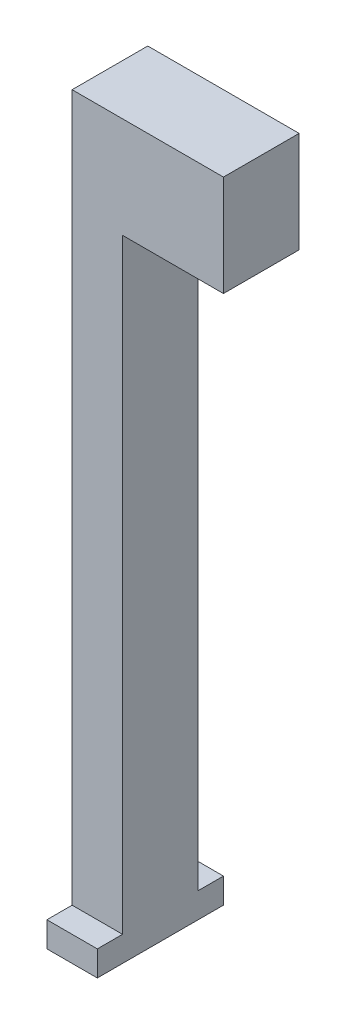
ISO-10303-21;
HEADER;
FILE_DESCRIPTION(('STEP AP214'),'2;1');
FILE_NAME('part.step','',(''),(''),'','','');
FILE_SCHEMA(('AUTOMOTIVE_DESIGN { 1 0 10303 214 1 1 1 1 }'));
ENDSEC;
DATA;
#1=APPLICATION_CONTEXT('core data for automotive mechanical design processes');
#2=APPLICATION_PROTOCOL_DEFINITION('international standard','automotive_design',2000,#1);
#3=PRODUCT_CONTEXT('',#1,'mechanical');
#4=PRODUCT('Part','Part','',(#3));
#5=PRODUCT_RELATED_PRODUCT_CATEGORY('part','',(#4));
#6=PRODUCT_DEFINITION_FORMATION('','',#4);
#7=PRODUCT_DEFINITION_CONTEXT('part definition',#1,'design');
#8=PRODUCT_DEFINITION('design','',#6,#7);
#9=PRODUCT_DEFINITION_SHAPE('','',#8);
#10=(LENGTH_UNIT() NAMED_UNIT(*) SI_UNIT(.MILLI.,.METRE.));
#11=(NAMED_UNIT(*) PLANE_ANGLE_UNIT() SI_UNIT($,.RADIAN.));
#12=(NAMED_UNIT(*) SI_UNIT($,.STERADIAN.) SOLID_ANGLE_UNIT());
#13=UNCERTAINTY_MEASURE_WITH_UNIT(LENGTH_MEASURE(1.E-05),#10,'distance_accuracy_value','');
#14=(GEOMETRIC_REPRESENTATION_CONTEXT(3) GLOBAL_UNCERTAINTY_ASSIGNED_CONTEXT((#13)) GLOBAL_UNIT_ASSIGNED_CONTEXT((#10,
#11,#12)) REPRESENTATION_CONTEXT('',''));
#15=CARTESIAN_POINT('',(0.,0.,0.));
#16=DIRECTION('',(0.,0.,1.));
#17=DIRECTION('',(1.,0.,0.));
#18=AXIS2_PLACEMENT_3D('',#15,#16,#17);
#19=CARTESIAN_POINT('',(-15.,0.,15.));
#20=DIRECTION('',(-1.,0.,0.));
#21=DIRECTION('',(0.,0.,1.));
#22=AXIS2_PLACEMENT_3D('',#19,#20,#21);
#23=PLANE('',#22);
#24=DIRECTION('',(0.,1.,0.));
#25=VECTOR('',#24,1.);
#26=CARTESIAN_POINT('',(-15.,0.,0.));
#27=LINE('',#26,#25);
#28=CARTESIAN_POINT('',(-15.,-130.,0.));
#29=VERTEX_POINT('',#28);
#30=CARTESIAN_POINT('',(-15.,10.,0.));
#31=VERTEX_POINT('',#30);
#32=EDGE_CURVE('E113',#29,#31,#27,.T.);
#33=ORIENTED_EDGE('',*,*,#32,.F.);
#34=DIRECTION('',(0.,0.,1.));
#35=VECTOR('',#34,1.);
#36=CARTESIAN_POINT('',(-15.,-130.,-5.));
#37=LINE('',#36,#35);
#38=CARTESIAN_POINT('',(-15.,-130.,-5.));
#39=VERTEX_POINT('',#38);
#40=EDGE_CURVE('E117',#39,#29,#37,.T.);
#41=ORIENTED_EDGE('',*,*,#40,.F.);
#42=DIRECTION('',(0.,-1.,0.));
#43=VECTOR('',#42,1.);
#44=CARTESIAN_POINT('',(-15.,-130.,-5.));
#45=LINE('',#44,#43);
#46=CARTESIAN_POINT('',(-15.,-135.,-5.));
#47=VERTEX_POINT('',#46);
#48=EDGE_CURVE('E172',#39,#47,#45,.T.);
#49=ORIENTED_EDGE('',*,*,#48,.T.);
#50=DIRECTION('',(0.,0.,1.));
#51=VECTOR('',#50,1.);
#52=CARTESIAN_POINT('',(-15.,-135.,-5.));
#53=LINE('',#52,#51);
#54=CARTESIAN_POINT('',(-15.,-135.,20.));
#55=VERTEX_POINT('',#54);
#56=EDGE_CURVE('E167',#47,#55,#53,.T.);
#57=ORIENTED_EDGE('',*,*,#56,.T.);
#58=DIRECTION('',(0.,-1.,0.));
#59=VECTOR('',#58,1.);
#60=CARTESIAN_POINT('',(-15.,-130.,20.));
#61=LINE('',#60,#59);
#62=CARTESIAN_POINT('',(-15.,-130.,20.));
#63=VERTEX_POINT('',#62);
#64=EDGE_CURVE('E171',#63,#55,#61,.T.);
#65=ORIENTED_EDGE('',*,*,#64,.F.);
#66=CARTESIAN_POINT('',(-15.,-130.,15.));
#67=VERTEX_POINT('',#66);
#68=EDGE_CURVE('E207',#67,#63,#37,.T.);
#69=ORIENTED_EDGE('',*,*,#68,.F.);
#70=DIRECTION('',(0.,1.,0.));
#71=VECTOR('',#70,1.);
#72=CARTESIAN_POINT('',(-15.,0.,15.));
#73=LINE('',#72,#71);
#74=CARTESIAN_POINT('',(-15.,10.,15.));
#75=VERTEX_POINT('',#74);
#76=EDGE_CURVE('E127',#67,#75,#73,.T.);
#77=ORIENTED_EDGE('',*,*,#76,.T.);
#78=DIRECTION('',(0.,0.,-1.));
#79=VECTOR('',#78,1.);
#80=CARTESIAN_POINT('',(-15.,10.,15.));
#81=LINE('',#80,#79);
#82=EDGE_CURVE('E74',#75,#31,#81,.T.);
#83=ORIENTED_EDGE('',*,*,#82,.T.);
#84=EDGE_LOOP('',(#33,#41,#49,#57,#65,#69,#77,#83));
#85=FACE_BOUND('',#84,.T.);
#86=ADVANCED_FACE('F35',(#85),#23,.T.);
#87=CARTESIAN_POINT('',(-5.00000000000001,0.,15.));
#88=DIRECTION('',(1.,0.,0.));
#89=DIRECTION('',(0.,1.,0.));
#90=AXIS2_PLACEMENT_3D('',#87,#88,#89);
#91=PLANE('',#90);
#92=DIRECTION('',(0.,-1.,0.));
#93=VECTOR('',#92,1.);
#94=CARTESIAN_POINT('',(-5.00000000000001,0.,0.));
#95=LINE('',#94,#93);
#96=CARTESIAN_POINT('',(-5.00000000000001,-9.99999999999999,0.));
#97=VERTEX_POINT('',#96);
#98=CARTESIAN_POINT('',(-5.,-130.,0.));
#99=VERTEX_POINT('',#98);
#100=EDGE_CURVE('E120',#97,#99,#95,.T.);
#101=ORIENTED_EDGE('',*,*,#100,.F.);
#102=DIRECTION('',(0.,0.,-1.));
#103=VECTOR('',#102,1.);
#104=CARTESIAN_POINT('',(-5.00000000000001,-9.99999999999999,15.));
#105=LINE('',#104,#103);
#106=CARTESIAN_POINT('',(-5.00000000000001,-9.99999999999999,15.));
#107=VERTEX_POINT('',#106);
#108=EDGE_CURVE('E11',#107,#97,#105,.T.);
#109=ORIENTED_EDGE('',*,*,#108,.F.);
#110=DIRECTION('',(0.,-1.,0.));
#111=VECTOR('',#110,1.);
#112=CARTESIAN_POINT('',(-5.00000000000001,0.,15.));
#113=LINE('',#112,#111);
#114=CARTESIAN_POINT('',(-5.,-130.,15.));
#115=VERTEX_POINT('',#114);
#116=EDGE_CURVE('E106',#107,#115,#113,.T.);
#117=ORIENTED_EDGE('',*,*,#116,.T.);
#118=DIRECTION('',(0.,0.,1.));
#119=VECTOR('',#118,1.);
#120=CARTESIAN_POINT('',(-5.,-130.,-5.));
#121=LINE('',#120,#119);
#122=CARTESIAN_POINT('',(-5.,-130.,20.));
#123=VERTEX_POINT('',#122);
#124=EDGE_CURVE('E83',#115,#123,#121,.T.);
#125=ORIENTED_EDGE('',*,*,#124,.T.);
#126=DIRECTION('',(0.,1.,0.));
#127=VECTOR('',#126,1.);
#128=CARTESIAN_POINT('',(-5.,-130.,20.));
#129=LINE('',#128,#127);
#130=CARTESIAN_POINT('',(-5.,-135.,20.));
#131=VERTEX_POINT('',#130);
#132=EDGE_CURVE('E185',#131,#123,#129,.T.);
#133=ORIENTED_EDGE('',*,*,#132,.F.);
#134=DIRECTION('',(0.,0.,1.));
#135=VECTOR('',#134,1.);
#136=CARTESIAN_POINT('',(-5.,-135.,-5.));
#137=LINE('',#136,#135);
#138=CARTESIAN_POINT('',(-5.,-135.,-5.));
#139=VERTEX_POINT('',#138);
#140=EDGE_CURVE('E176',#139,#131,#137,.T.);
#141=ORIENTED_EDGE('',*,*,#140,.F.);
#142=DIRECTION('',(0.,1.,0.));
#143=VECTOR('',#142,1.);
#144=CARTESIAN_POINT('',(-5.,-130.,-5.));
#145=LINE('',#144,#143);
#146=CARTESIAN_POINT('',(-5.,-130.,-5.));
#147=VERTEX_POINT('',#146);
#148=EDGE_CURVE('E202',#139,#147,#145,.T.);
#149=ORIENTED_EDGE('',*,*,#148,.T.);
#150=EDGE_CURVE('E208',#147,#99,#121,.T.);
#151=ORIENTED_EDGE('',*,*,#150,.T.);
#152=EDGE_LOOP('',(#101,#109,#117,#125,#133,#141,#149,#151));
#153=FACE_BOUND('',#152,.T.);
#154=ADVANCED_FACE('F214',(#153),#91,.T.);
#155=CARTESIAN_POINT('',(0.,-9.99999999999999,15.));
#156=DIRECTION('',(0.,-1.,0.));
#157=DIRECTION('',(0.,0.,-1.));
#158=AXIS2_PLACEMENT_3D('',#155,#156,#157);
#159=PLANE('',#158);
#160=CARTESIAN_POINT('',(4.99999999999998,-9.99999999999999,7.5));
#161=DIRECTION('',(0.,-1.,0.));
#162=DIRECTION('',(0.,0.,-1.));
#163=AXIS2_PLACEMENT_3D('',#160,#161,#162);
#164=CIRCLE('',#163,2.51727722816741);
#165=CARTESIAN_POINT('',(4.99999999999998,-9.99999999999999,4.98272277183259));
#166=VERTEX_POINT('',#165);
#167=EDGE_CURVE('E193',#166,#166,#164,.T.);
#168=ORIENTED_EDGE('',*,*,#167,.F.);
#169=EDGE_LOOP('',(#168));
#170=FACE_BOUND('',#169,.T.);
#171=DIRECTION('',(-1.,0.,0.));
#172=VECTOR('',#171,1.);
#173=CARTESIAN_POINT('',(0.,-9.99999999999999,0.));
#174=LINE('',#173,#172);
#175=CARTESIAN_POINT('',(15.,-9.99999999999999,0.));
#176=VERTEX_POINT('',#175);
#177=EDGE_CURVE('E98',#176,#97,#174,.T.);
#178=ORIENTED_EDGE('',*,*,#177,.F.);
#179=DIRECTION('',(0.,0.,-1.));
#180=VECTOR('',#179,1.);
#181=CARTESIAN_POINT('',(15.,-9.99999999999999,15.));
#182=LINE('',#181,#180);
#183=CARTESIAN_POINT('',(15.,-9.99999999999999,15.));
#184=VERTEX_POINT('',#183);
#185=EDGE_CURVE('E43',#184,#176,#182,.T.);
#186=ORIENTED_EDGE('',*,*,#185,.F.);
#187=DIRECTION('',(-1.,0.,0.));
#188=VECTOR('',#187,1.);
#189=CARTESIAN_POINT('',(0.,-9.99999999999999,15.));
#190=LINE('',#189,#188);
#191=EDGE_CURVE('E96',#184,#107,#190,.T.);
#192=ORIENTED_EDGE('',*,*,#191,.T.);
#193=ORIENTED_EDGE('',*,*,#108,.T.);
#194=EDGE_LOOP('',(#178,#186,#192,#193));
#195=FACE_BOUND('',#194,.T.);
#196=ADVANCED_FACE('F94',(#170,#195),#159,.T.);
#197=CARTESIAN_POINT('',(15.,0.,15.));
#198=DIRECTION('',(-1.,0.,0.));
#199=DIRECTION('',(0.,0.,1.));
#200=AXIS2_PLACEMENT_3D('',#197,#198,#199);
#201=PLANE('',#200);
#202=DIRECTION('',(0.,1.,0.));
#203=VECTOR('',#202,1.);
#204=CARTESIAN_POINT('',(15.,0.,0.));
#205=LINE('',#204,#203);
#206=CARTESIAN_POINT('',(15.,10.,0.));
#207=VERTEX_POINT('',#206);
#208=EDGE_CURVE('E67',#176,#207,#205,.T.);
#209=ORIENTED_EDGE('',*,*,#208,.T.);
#210=DIRECTION('',(0.,0.,-1.));
#211=VECTOR('',#210,1.);
#212=CARTESIAN_POINT('',(15.,10.,15.));
#213=LINE('',#212,#211);
#214=CARTESIAN_POINT('',(15.,10.,15.));
#215=VERTEX_POINT('',#214);
#216=EDGE_CURVE('E99',#215,#207,#213,.T.);
#217=ORIENTED_EDGE('',*,*,#216,.F.);
#218=DIRECTION('',(0.,1.,0.));
#219=VECTOR('',#218,1.);
#220=CARTESIAN_POINT('',(15.,0.,15.));
#221=LINE('',#220,#219);
#222=EDGE_CURVE('E100',#184,#215,#221,.T.);
#223=ORIENTED_EDGE('',*,*,#222,.F.);
#224=ORIENTED_EDGE('',*,*,#185,.T.);
#225=EDGE_LOOP('',(#209,#217,#223,#224));
#226=FACE_BOUND('',#225,.T.);
#227=ADVANCED_FACE('F101',(#226),#201,.F.);
#228=CARTESIAN_POINT('',(0.,10.,15.));
#229=DIRECTION('',(0.,-1.,0.));
#230=DIRECTION('',(0.,0.,-1.));
#231=AXIS2_PLACEMENT_3D('',#228,#229,#230);
#232=PLANE('',#231);
#233=DIRECTION('',(-1.,0.,0.));
#234=VECTOR('',#233,1.);
#235=CARTESIAN_POINT('',(0.,10.,0.));
#236=LINE('',#235,#234);
#237=EDGE_CURVE('E125',#207,#31,#236,.T.);
#238=ORIENTED_EDGE('',*,*,#237,.T.);
#239=ORIENTED_EDGE('',*,*,#82,.F.);
#240=DIRECTION('',(-1.,0.,0.));
#241=VECTOR('',#240,1.);
#242=CARTESIAN_POINT('',(0.,10.,15.));
#243=LINE('',#242,#241);
#244=EDGE_CURVE('E51',#215,#75,#243,.T.);
#245=ORIENTED_EDGE('',*,*,#244,.F.);
#246=ORIENTED_EDGE('',*,*,#216,.T.);
#247=EDGE_LOOP('',(#238,#239,#245,#246));
#248=FACE_BOUND('',#247,.T.);
#249=ADVANCED_FACE('F131',(#248),#232,.F.);
#250=CARTESIAN_POINT('',(0.,0.,15.));
#251=DIRECTION('',(0.,0.,1.));
#252=DIRECTION('',(1.,0.,0.));
#253=AXIS2_PLACEMENT_3D('',#250,#251,#252);
#254=PLANE('',#253);
#255=ORIENTED_EDGE('',*,*,#76,.F.);
#256=DIRECTION('',(1.,0.,0.));
#257=VECTOR('',#256,1.);
#258=CARTESIAN_POINT('',(0.,-130.,15.));
#259=LINE('',#258,#257);
#260=EDGE_CURVE('E108',#67,#115,#259,.T.);
#261=ORIENTED_EDGE('',*,*,#260,.T.);
#262=ORIENTED_EDGE('',*,*,#116,.F.);
#263=ORIENTED_EDGE('',*,*,#191,.F.);
#264=ORIENTED_EDGE('',*,*,#222,.T.);
#265=ORIENTED_EDGE('',*,*,#244,.T.);
#266=EDGE_LOOP('',(#255,#261,#262,#263,#264,#265));
#267=FACE_BOUND('',#266,.T.);
#268=ADVANCED_FACE('F104',(#267),#254,.T.);
#269=CARTESIAN_POINT('',(0.,0.,0.));
#270=DIRECTION('',(0.,0.,1.));
#271=DIRECTION('',(1.,0.,0.));
#272=AXIS2_PLACEMENT_3D('',#269,#270,#271);
#273=PLANE('',#272);
#274=ORIENTED_EDGE('',*,*,#32,.T.);
#275=ORIENTED_EDGE('',*,*,#237,.F.);
#276=ORIENTED_EDGE('',*,*,#208,.F.);
#277=ORIENTED_EDGE('',*,*,#177,.T.);
#278=ORIENTED_EDGE('',*,*,#100,.T.);
#279=DIRECTION('',(1.,0.,0.));
#280=VECTOR('',#279,1.);
#281=CARTESIAN_POINT('',(0.,-130.,0.));
#282=LINE('',#281,#280);
#283=EDGE_CURVE('E116',#29,#99,#282,.T.);
#284=ORIENTED_EDGE('',*,*,#283,.F.);
#285=EDGE_LOOP('',(#274,#275,#276,#277,#278,#284));
#286=FACE_BOUND('',#285,.T.);
#287=ADVANCED_FACE('F133',(#286),#273,.F.);
#288=CARTESIAN_POINT('',(-15.,-130.,-5.));
#289=DIRECTION('',(0.,1.,0.));
#290=DIRECTION('',(0.,0.,1.));
#291=AXIS2_PLACEMENT_3D('',#288,#289,#290);
#292=PLANE('',#291);
#293=ORIENTED_EDGE('',*,*,#260,.F.);
#294=ORIENTED_EDGE('',*,*,#68,.T.);
#295=DIRECTION('',(-1.,0.,0.));
#296=VECTOR('',#295,1.);
#297=CARTESIAN_POINT('',(-15.,-130.,20.));
#298=LINE('',#297,#296);
#299=EDGE_CURVE('E189',#123,#63,#298,.T.);
#300=ORIENTED_EDGE('',*,*,#299,.F.);
#301=ORIENTED_EDGE('',*,*,#124,.F.);
#302=EDGE_LOOP('',(#293,#294,#300,#301));
#303=FACE_BOUND('',#302,.T.);
#304=ADVANCED_FACE('F247',(#303),#292,.T.);
#305=ORIENTED_EDGE('',*,*,#40,.T.);
#306=ORIENTED_EDGE('',*,*,#283,.T.);
#307=ORIENTED_EDGE('',*,*,#150,.F.);
#308=DIRECTION('',(-1.,0.,0.));
#309=VECTOR('',#308,1.);
#310=CARTESIAN_POINT('',(-15.,-130.,-5.));
#311=LINE('',#310,#309);
#312=EDGE_CURVE('E177',#147,#39,#311,.T.);
#313=ORIENTED_EDGE('',*,*,#312,.T.);
#314=EDGE_LOOP('',(#305,#306,#307,#313));
#315=FACE_BOUND('',#314,.T.);
#316=ADVANCED_FACE('F215',(#315),#292,.T.);
#317=CARTESIAN_POINT('',(-15.,-135.,-5.));
#318=DIRECTION('',(0.,-1.,0.));
#319=DIRECTION('',(0.,0.,-1.));
#320=AXIS2_PLACEMENT_3D('',#317,#318,#319);
#321=PLANE('',#320);
#322=ORIENTED_EDGE('',*,*,#140,.T.);
#323=DIRECTION('',(1.,0.,0.));
#324=VECTOR('',#323,1.);
#325=CARTESIAN_POINT('',(-15.,-135.,20.));
#326=LINE('',#325,#324);
#327=EDGE_CURVE('E180',#55,#131,#326,.T.);
#328=ORIENTED_EDGE('',*,*,#327,.F.);
#329=ORIENTED_EDGE('',*,*,#56,.F.);
#330=DIRECTION('',(1.,0.,0.));
#331=VECTOR('',#330,1.);
#332=CARTESIAN_POINT('',(-15.,-135.,-5.));
#333=LINE('',#332,#331);
#334=EDGE_CURVE('E200',#47,#139,#333,.T.);
#335=ORIENTED_EDGE('',*,*,#334,.T.);
#336=EDGE_LOOP('',(#322,#328,#329,#335));
#337=FACE_BOUND('',#336,.T.);
#338=ADVANCED_FACE('F181',(#337),#321,.T.);
#339=CARTESIAN_POINT('',(0.,0.,-5.));
#340=DIRECTION('',(0.,0.,1.));
#341=DIRECTION('',(1.,0.,0.));
#342=AXIS2_PLACEMENT_3D('',#339,#340,#341);
#343=PLANE('',#342);
#344=ORIENTED_EDGE('',*,*,#48,.F.);
#345=ORIENTED_EDGE('',*,*,#312,.F.);
#346=ORIENTED_EDGE('',*,*,#148,.F.);
#347=ORIENTED_EDGE('',*,*,#334,.F.);
#348=EDGE_LOOP('',(#344,#345,#346,#347));
#349=FACE_BOUND('',#348,.T.);
#350=ADVANCED_FACE('F219',(#349),#343,.F.);
#351=CARTESIAN_POINT('',(0.,0.,20.));
#352=DIRECTION('',(0.,0.,1.));
#353=DIRECTION('',(1.,0.,0.));
#354=AXIS2_PLACEMENT_3D('',#351,#352,#353);
#355=PLANE('',#354);
#356=ORIENTED_EDGE('',*,*,#64,.T.);
#357=ORIENTED_EDGE('',*,*,#327,.T.);
#358=ORIENTED_EDGE('',*,*,#132,.T.);
#359=ORIENTED_EDGE('',*,*,#299,.T.);
#360=EDGE_LOOP('',(#356,#357,#358,#359));
#361=FACE_BOUND('',#360,.T.);
#362=ADVANCED_FACE('F188',(#361),#355,.T.);
#363=CARTESIAN_POINT('',(4.99999999999998,-8.99999999999999,7.5));
#364=DIRECTION('',(0.,-1.,0.));
#365=DIRECTION('',(0.,0.,-1.));
#366=AXIS2_PLACEMENT_3D('',#363,#364,#365);
#367=CYLINDRICAL_SURFACE('',#366,2.51727722816741);
#368=CARTESIAN_POINT('',(4.99999999999998,-8.99999999999999,7.5));
#369=DIRECTION('',(0.,-1.,0.));
#370=DIRECTION('',(0.,0.,-1.));
#371=AXIS2_PLACEMENT_3D('',#368,#369,#370);
#372=CIRCLE('',#371,2.51727722816741);
#373=CARTESIAN_POINT('',(4.99999999999998,-8.99999999999999,4.98272277183259));
#374=VERTEX_POINT('',#373);
#375=EDGE_CURVE('E190',#374,#374,#372,.T.);
#376=ORIENTED_EDGE('',*,*,#375,.F.);
#377=EDGE_LOOP('',(#376));
#378=FACE_BOUND('',#377,.T.);
#379=ORIENTED_EDGE('',*,*,#167,.T.);
#380=EDGE_LOOP('',(#379));
#381=FACE_BOUND('',#380,.T.);
#382=ADVANCED_FACE('F226',(#378,#381),#367,.F.);
#383=CARTESIAN_POINT('',(4.99999999999998,-8.99999999999999,7.5));
#384=DIRECTION('',(0.,-1.,0.));
#385=DIRECTION('',(0.,0.,-1.));
#386=AXIS2_PLACEMENT_3D('',#383,#384,#385);
#387=PLANE('',#386);
#388=ORIENTED_EDGE('',*,*,#375,.T.);
#389=EDGE_LOOP('',(#388));
#390=FACE_BOUND('',#389,.T.);
#391=ADVANCED_FACE('F287',(#390),#387,.T.);
#392=CLOSED_SHELL('',(#86,#154,#196,#227,#249,#268,#287,#304,#316,#338,#350,#362,#382,#391));
#393=MANIFOLD_SOLID_BREP('B2',#392);
#394=ADVANCED_BREP_SHAPE_REPRESENTATION('',(#18,#393),#14);
#395=SHAPE_DEFINITION_REPRESENTATION(#9,#394);
ENDSEC;
END-ISO-10303-21;
